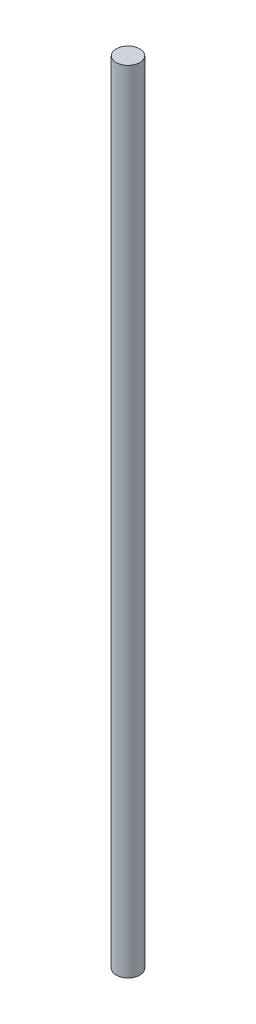
ISO-10303-21;
HEADER;
FILE_DESCRIPTION(('STEP AP214'),'2;1');
FILE_NAME('part.step','',(''),(''),'','','');
FILE_SCHEMA(('AUTOMOTIVE_DESIGN { 1 0 10303 214 1 1 1 1 }'));
ENDSEC;
DATA;
#1=APPLICATION_CONTEXT('core data for automotive mechanical design processes');
#2=APPLICATION_PROTOCOL_DEFINITION('international standard','automotive_design',2000,#1);
#3=PRODUCT_CONTEXT('',#1,'mechanical');
#4=PRODUCT('Part','Part','',(#3));
#5=PRODUCT_RELATED_PRODUCT_CATEGORY('part','',(#4));
#6=PRODUCT_DEFINITION_FORMATION('','',#4);
#7=PRODUCT_DEFINITION_CONTEXT('part definition',#1,'design');
#8=PRODUCT_DEFINITION('design','',#6,#7);
#9=PRODUCT_DEFINITION_SHAPE('','',#8);
#10=(LENGTH_UNIT() NAMED_UNIT(*) SI_UNIT(.MILLI.,.METRE.));
#11=(NAMED_UNIT(*) PLANE_ANGLE_UNIT() SI_UNIT($,.RADIAN.));
#12=(NAMED_UNIT(*) SI_UNIT($,.STERADIAN.) SOLID_ANGLE_UNIT());
#13=UNCERTAINTY_MEASURE_WITH_UNIT(LENGTH_MEASURE(1.E-05),#10,'distance_accuracy_value','');
#14=(GEOMETRIC_REPRESENTATION_CONTEXT(3) GLOBAL_UNCERTAINTY_ASSIGNED_CONTEXT((#13)) GLOBAL_UNIT_ASSIGNED_CONTEXT((#10,
#11,#12)) REPRESENTATION_CONTEXT('',''));
#15=CARTESIAN_POINT('',(0.,0.,0.));
#16=DIRECTION('',(0.,0.,1.));
#17=DIRECTION('',(1.,0.,0.));
#18=AXIS2_PLACEMENT_3D('',#15,#16,#17);
#19=CARTESIAN_POINT('',(0.,100.,0.));
#20=DIRECTION('',(0.,-1.,0.));
#21=DIRECTION('',(0.,0.,-1.));
#22=AXIS2_PLACEMENT_3D('',#19,#20,#21);
#23=CYLINDRICAL_SURFACE('',#22,1.5);
#24=CARTESIAN_POINT('',(0.,100.,0.));
#25=DIRECTION('',(0.,1.,0.));
#26=DIRECTION('',(0.,0.,1.));
#27=AXIS2_PLACEMENT_3D('',#24,#25,#26);
#28=CIRCLE('',#27,1.5);
#29=CARTESIAN_POINT('',(0.,100.,1.5));
#30=VERTEX_POINT('',#29);
#31=EDGE_CURVE('E10',#30,#30,#28,.T.);
#32=ORIENTED_EDGE('',*,*,#31,.F.);
#33=EDGE_LOOP('',(#32));
#34=FACE_BOUND('',#33,.T.);
#35=CARTESIAN_POINT('',(0.,0.,0.));
#36=DIRECTION('',(0.,1.,0.));
#37=DIRECTION('',(0.,0.,1.));
#38=AXIS2_PLACEMENT_3D('',#35,#36,#37);
#39=CIRCLE('',#38,1.5);
#40=CARTESIAN_POINT('',(0.,0.,1.5));
#41=VERTEX_POINT('',#40);
#42=EDGE_CURVE('E34',#41,#41,#39,.T.);
#43=ORIENTED_EDGE('',*,*,#42,.T.);
#44=EDGE_LOOP('',(#43));
#45=FACE_BOUND('',#44,.T.);
#46=ADVANCED_FACE('F31',(#34,#45),#23,.T.);
#47=CARTESIAN_POINT('',(0.,100.,0.));
#48=DIRECTION('',(0.,1.,0.));
#49=DIRECTION('',(0.,0.,1.));
#50=AXIS2_PLACEMENT_3D('',#47,#48,#49);
#51=PLANE('',#50);
#52=ORIENTED_EDGE('',*,*,#31,.T.);
#53=EDGE_LOOP('',(#52));
#54=FACE_BOUND('',#53,.T.);
#55=ADVANCED_FACE('F46',(#54),#51,.T.);
#56=CARTESIAN_POINT('',(0.,0.,0.));
#57=DIRECTION('',(0.,1.,0.));
#58=DIRECTION('',(0.,0.,1.));
#59=AXIS2_PLACEMENT_3D('',#56,#57,#58);
#60=PLANE('',#59);
#61=ORIENTED_EDGE('',*,*,#42,.F.);
#62=EDGE_LOOP('',(#61));
#63=FACE_BOUND('',#62,.T.);
#64=ADVANCED_FACE('F44',(#63),#60,.F.);
#65=CLOSED_SHELL('',(#46,#55,#64));
#66=MANIFOLD_SOLID_BREP('B2',#65);
#67=ADVANCED_BREP_SHAPE_REPRESENTATION('',(#18,#66),#14);
#68=SHAPE_DEFINITION_REPRESENTATION(#9,#67);
ENDSEC;
END-ISO-10303-21;
